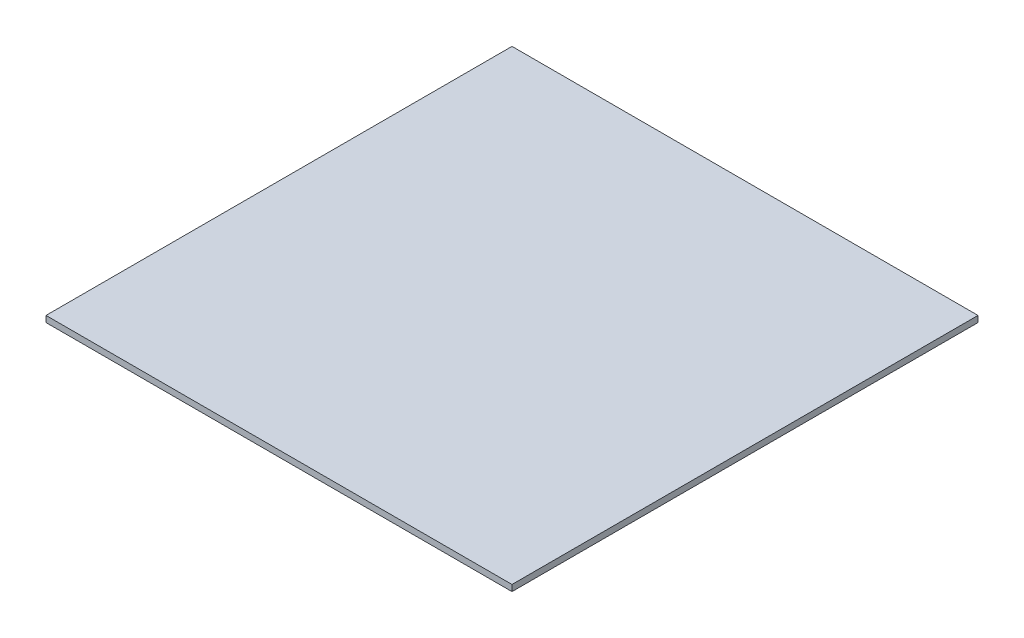
ISO-10303-21;
HEADER;
FILE_DESCRIPTION(('STEP AP214'),'2;1');
FILE_NAME('part.step','',(''),(''),'','','');
FILE_SCHEMA(('AUTOMOTIVE_DESIGN { 1 0 10303 214 1 1 1 1 }'));
ENDSEC;
DATA;
#1=APPLICATION_CONTEXT('core data for automotive mechanical design processes');
#2=APPLICATION_PROTOCOL_DEFINITION('international standard','automotive_design',2000,#1);
#3=PRODUCT_CONTEXT('',#1,'mechanical');
#4=PRODUCT('Part','Part','',(#3));
#5=PRODUCT_RELATED_PRODUCT_CATEGORY('part','',(#4));
#6=PRODUCT_DEFINITION_FORMATION('','',#4);
#7=PRODUCT_DEFINITION_CONTEXT('part definition',#1,'design');
#8=PRODUCT_DEFINITION('design','',#6,#7);
#9=PRODUCT_DEFINITION_SHAPE('','',#8);
#10=(LENGTH_UNIT() NAMED_UNIT(*) SI_UNIT(.MILLI.,.METRE.));
#11=(NAMED_UNIT(*) PLANE_ANGLE_UNIT() SI_UNIT($,.RADIAN.));
#12=(NAMED_UNIT(*) SI_UNIT($,.STERADIAN.) SOLID_ANGLE_UNIT());
#13=UNCERTAINTY_MEASURE_WITH_UNIT(LENGTH_MEASURE(1.E-05),#10,'distance_accuracy_value','');
#14=(GEOMETRIC_REPRESENTATION_CONTEXT(3) GLOBAL_UNCERTAINTY_ASSIGNED_CONTEXT((#13)) GLOBAL_UNIT_ASSIGNED_CONTEXT((#10,
#11,#12)) REPRESENTATION_CONTEXT('',''));
#15=CARTESIAN_POINT('',(0.,0.,0.));
#16=DIRECTION('',(0.,0.,1.));
#17=DIRECTION('',(1.,0.,0.));
#18=AXIS2_PLACEMENT_3D('',#15,#16,#17);
#19=CARTESIAN_POINT('',(75.,2.,-75.));
#20=DIRECTION('',(-1.,0.,0.));
#21=DIRECTION('',(0.,0.,1.));
#22=AXIS2_PLACEMENT_3D('',#19,#20,#21);
#23=PLANE('',#22);
#24=DIRECTION('',(0.,0.,-1.));
#25=VECTOR('',#24,1.);
#26=CARTESIAN_POINT('',(75.,0.,-75.));
#27=LINE('',#26,#25);
#28=CARTESIAN_POINT('',(75.,0.,75.));
#29=VERTEX_POINT('',#28);
#30=CARTESIAN_POINT('',(75.,0.,-75.));
#31=VERTEX_POINT('',#30);
#32=EDGE_CURVE('E96',#29,#31,#27,.T.);
#33=ORIENTED_EDGE('',*,*,#32,.T.);
#34=DIRECTION('',(0.,-1.,0.));
#35=VECTOR('',#34,1.);
#36=CARTESIAN_POINT('',(75.,2.,-75.));
#37=LINE('',#36,#35);
#38=CARTESIAN_POINT('',(75.,2.,-75.));
#39=VERTEX_POINT('',#38);
#40=EDGE_CURVE('E11',#39,#31,#37,.T.);
#41=ORIENTED_EDGE('',*,*,#40,.F.);
#42=DIRECTION('',(0.,0.,-1.));
#43=VECTOR('',#42,1.);
#44=CARTESIAN_POINT('',(75.,2.,-75.));
#45=LINE('',#44,#43);
#46=CARTESIAN_POINT('',(75.,2.,75.));
#47=VERTEX_POINT('',#46);
#48=EDGE_CURVE('E84',#47,#39,#45,.T.);
#49=ORIENTED_EDGE('',*,*,#48,.F.);
#50=DIRECTION('',(0.,-1.,0.));
#51=VECTOR('',#50,1.);
#52=CARTESIAN_POINT('',(75.,2.,75.));
#53=LINE('',#52,#51);
#54=EDGE_CURVE('E92',#47,#29,#53,.T.);
#55=ORIENTED_EDGE('',*,*,#54,.T.);
#56=EDGE_LOOP('',(#33,#41,#49,#55));
#57=FACE_BOUND('',#56,.T.);
#58=ADVANCED_FACE('F33',(#57),#23,.F.);
#59=CARTESIAN_POINT('',(-75.,2.,-75.));
#60=DIRECTION('',(0.,0.,1.));
#61=DIRECTION('',(1.,0.,0.));
#62=AXIS2_PLACEMENT_3D('',#59,#60,#61);
#63=PLANE('',#62);
#64=DIRECTION('',(-1.,0.,0.));
#65=VECTOR('',#64,1.);
#66=CARTESIAN_POINT('',(-75.,0.,-75.));
#67=LINE('',#66,#65);
#68=CARTESIAN_POINT('',(-75.,0.,-75.));
#69=VERTEX_POINT('',#68);
#70=EDGE_CURVE('E88',#31,#69,#67,.T.);
#71=ORIENTED_EDGE('',*,*,#70,.T.);
#72=DIRECTION('',(0.,-1.,0.));
#73=VECTOR('',#72,1.);
#74=CARTESIAN_POINT('',(-75.,2.,-75.));
#75=LINE('',#74,#73);
#76=CARTESIAN_POINT('',(-75.,2.,-75.));
#77=VERTEX_POINT('',#76);
#78=EDGE_CURVE('E41',#77,#69,#75,.T.);
#79=ORIENTED_EDGE('',*,*,#78,.F.);
#80=DIRECTION('',(-1.,0.,0.));
#81=VECTOR('',#80,1.);
#82=CARTESIAN_POINT('',(-75.,2.,-75.));
#83=LINE('',#82,#81);
#84=EDGE_CURVE('E79',#39,#77,#83,.T.);
#85=ORIENTED_EDGE('',*,*,#84,.F.);
#86=ORIENTED_EDGE('',*,*,#40,.T.);
#87=EDGE_LOOP('',(#71,#79,#85,#86));
#88=FACE_BOUND('',#87,.T.);
#89=ADVANCED_FACE('F87',(#88),#63,.F.);
#90=CARTESIAN_POINT('',(-75.,2.,-75.));
#91=DIRECTION('',(1.,0.,0.));
#92=DIRECTION('',(0.,0.,-1.));
#93=AXIS2_PLACEMENT_3D('',#90,#91,#92);
#94=PLANE('',#93);
#95=DIRECTION('',(0.,0.,1.));
#96=VECTOR('',#95,1.);
#97=CARTESIAN_POINT('',(-75.,0.,-75.));
#98=LINE('',#97,#96);
#99=CARTESIAN_POINT('',(-75.,0.,75.));
#100=VERTEX_POINT('',#99);
#101=EDGE_CURVE('E66',#69,#100,#98,.T.);
#102=ORIENTED_EDGE('',*,*,#101,.T.);
#103=DIRECTION('',(0.,-1.,0.));
#104=VECTOR('',#103,1.);
#105=CARTESIAN_POINT('',(-75.,2.,75.));
#106=LINE('',#105,#104);
#107=CARTESIAN_POINT('',(-75.,2.,75.));
#108=VERTEX_POINT('',#107);
#109=EDGE_CURVE('E89',#108,#100,#106,.T.);
#110=ORIENTED_EDGE('',*,*,#109,.F.);
#111=DIRECTION('',(0.,0.,1.));
#112=VECTOR('',#111,1.);
#113=CARTESIAN_POINT('',(-75.,2.,-75.));
#114=LINE('',#113,#112);
#115=EDGE_CURVE('E82',#77,#108,#114,.T.);
#116=ORIENTED_EDGE('',*,*,#115,.F.);
#117=ORIENTED_EDGE('',*,*,#78,.T.);
#118=EDGE_LOOP('',(#102,#110,#116,#117));
#119=FACE_BOUND('',#118,.T.);
#120=ADVANCED_FACE('F90',(#119),#94,.F.);
#121=CARTESIAN_POINT('',(-75.,2.,75.));
#122=DIRECTION('',(0.,0.,-1.));
#123=DIRECTION('',(-1.,0.,0.));
#124=AXIS2_PLACEMENT_3D('',#121,#122,#123);
#125=PLANE('',#124);
#126=DIRECTION('',(1.,0.,0.));
#127=VECTOR('',#126,1.);
#128=CARTESIAN_POINT('',(-75.,0.,75.));
#129=LINE('',#128,#127);
#130=EDGE_CURVE('E72',#100,#29,#129,.T.);
#131=ORIENTED_EDGE('',*,*,#130,.T.);
#132=ORIENTED_EDGE('',*,*,#54,.F.);
#133=DIRECTION('',(1.,0.,0.));
#134=VECTOR('',#133,1.);
#135=CARTESIAN_POINT('',(-75.,2.,75.));
#136=LINE('',#135,#134);
#137=EDGE_CURVE('E49',#108,#47,#136,.T.);
#138=ORIENTED_EDGE('',*,*,#137,.F.);
#139=ORIENTED_EDGE('',*,*,#109,.T.);
#140=EDGE_LOOP('',(#131,#132,#138,#139));
#141=FACE_BOUND('',#140,.T.);
#142=ADVANCED_FACE('F103',(#141),#125,.F.);
#143=CARTESIAN_POINT('',(0.,2.,0.));
#144=DIRECTION('',(0.,1.,0.));
#145=DIRECTION('',(0.,0.,1.));
#146=AXIS2_PLACEMENT_3D('',#143,#144,#145);
#147=PLANE('',#146);
#148=ORIENTED_EDGE('',*,*,#48,.T.);
#149=ORIENTED_EDGE('',*,*,#84,.T.);
#150=ORIENTED_EDGE('',*,*,#115,.T.);
#151=ORIENTED_EDGE('',*,*,#137,.T.);
#152=EDGE_LOOP('',(#148,#149,#150,#151));
#153=FACE_BOUND('',#152,.T.);
#154=ADVANCED_FACE('F80',(#153),#147,.T.);
#155=CARTESIAN_POINT('',(0.,0.,0.));
#156=DIRECTION('',(0.,1.,0.));
#157=DIRECTION('',(0.,0.,1.));
#158=AXIS2_PLACEMENT_3D('',#155,#156,#157);
#159=PLANE('',#158);
#160=ORIENTED_EDGE('',*,*,#32,.F.);
#161=ORIENTED_EDGE('',*,*,#130,.F.);
#162=ORIENTED_EDGE('',*,*,#101,.F.);
#163=ORIENTED_EDGE('',*,*,#70,.F.);
#164=EDGE_LOOP('',(#160,#161,#162,#163));
#165=FACE_BOUND('',#164,.T.);
#166=ADVANCED_FACE('F106',(#165),#159,.F.);
#167=CLOSED_SHELL('',(#58,#89,#120,#142,#154,#166));
#168=MANIFOLD_SOLID_BREP('B2',#167);
#169=ADVANCED_BREP_SHAPE_REPRESENTATION('',(#18,#168),#14);
#170=SHAPE_DEFINITION_REPRESENTATION(#9,#169);
ENDSEC;
END-ISO-10303-21;
